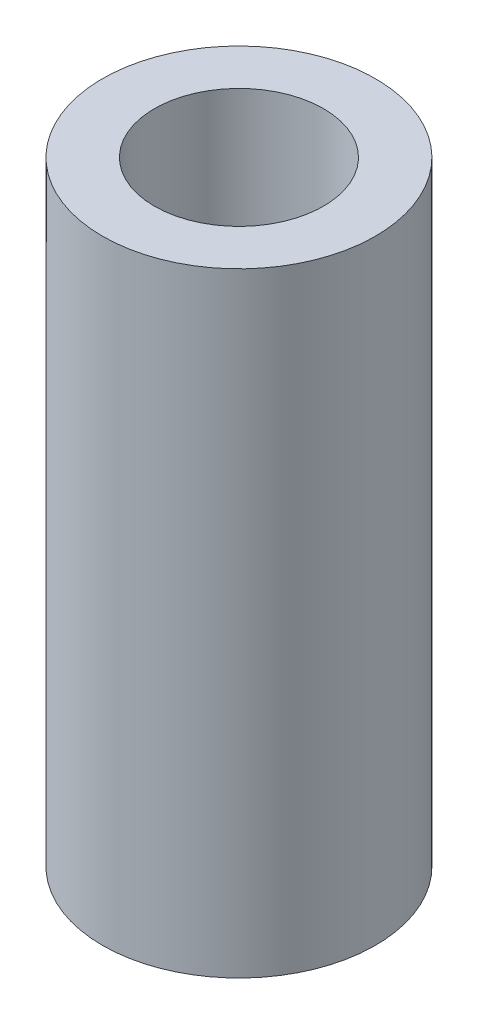
ISO-10303-21;
HEADER;
FILE_DESCRIPTION(('STEP AP214'),'2;1');
FILE_NAME('part.step','',(''),(''),'','','');
FILE_SCHEMA(('AUTOMOTIVE_DESIGN { 1 0 10303 214 1 1 1 1 }'));
ENDSEC;
DATA;
#1=APPLICATION_CONTEXT('core data for automotive mechanical design processes');
#2=APPLICATION_PROTOCOL_DEFINITION('international standard','automotive_design',2000,#1);
#3=PRODUCT_CONTEXT('',#1,'mechanical');
#4=PRODUCT('Part','Part','',(#3));
#5=PRODUCT_RELATED_PRODUCT_CATEGORY('part','',(#4));
#6=PRODUCT_DEFINITION_FORMATION('','',#4);
#7=PRODUCT_DEFINITION_CONTEXT('part definition',#1,'design');
#8=PRODUCT_DEFINITION('design','',#6,#7);
#9=PRODUCT_DEFINITION_SHAPE('','',#8);
#10=(LENGTH_UNIT() NAMED_UNIT(*) SI_UNIT(.MILLI.,.METRE.));
#11=(NAMED_UNIT(*) PLANE_ANGLE_UNIT() SI_UNIT($,.RADIAN.));
#12=(NAMED_UNIT(*) SI_UNIT($,.STERADIAN.) SOLID_ANGLE_UNIT());
#13=UNCERTAINTY_MEASURE_WITH_UNIT(LENGTH_MEASURE(1.E-05),#10,'distance_accuracy_value','');
#14=(GEOMETRIC_REPRESENTATION_CONTEXT(3) GLOBAL_UNCERTAINTY_ASSIGNED_CONTEXT((#13)) GLOBAL_UNIT_ASSIGNED_CONTEXT((#10,
#11,#12)) REPRESENTATION_CONTEXT('',''));
#15=CARTESIAN_POINT('',(0.,0.,0.));
#16=DIRECTION('',(0.,0.,1.));
#17=DIRECTION('',(1.,0.,0.));
#18=AXIS2_PLACEMENT_3D('',#15,#16,#17);
#19=CARTESIAN_POINT('',(0.,56.2607572446748,0.));
#20=DIRECTION('',(0.,-1.,0.));
#21=DIRECTION('',(0.,0.,-1.));
#22=AXIS2_PLACEMENT_3D('',#19,#20,#21);
#23=CYLINDRICAL_SURFACE('',#22,12.5);
#24=CARTESIAN_POINT('',(0.,56.2607572446748,0.));
#25=DIRECTION('',(0.,1.,0.));
#26=DIRECTION('',(0.,0.,1.));
#27=AXIS2_PLACEMENT_3D('',#24,#25,#26);
#28=CIRCLE('',#27,12.5);
#29=CARTESIAN_POINT('',(0.,56.2607572446748,12.5));
#30=VERTEX_POINT('',#29);
#31=EDGE_CURVE('E10',#30,#30,#28,.T.);
#32=ORIENTED_EDGE('',*,*,#31,.F.);
#33=EDGE_LOOP('',(#32));
#34=FACE_BOUND('',#33,.T.);
#35=CARTESIAN_POINT('',(0.,0.,0.));
#36=DIRECTION('',(0.,1.,0.));
#37=DIRECTION('',(0.,0.,1.));
#38=AXIS2_PLACEMENT_3D('',#35,#36,#37);
#39=CIRCLE('',#38,12.5);
#40=CARTESIAN_POINT('',(0.,0.,12.5));
#41=VERTEX_POINT('',#40);
#42=EDGE_CURVE('E37',#41,#41,#39,.T.);
#43=ORIENTED_EDGE('',*,*,#42,.T.);
#44=EDGE_LOOP('',(#43));
#45=FACE_BOUND('',#44,.T.);
#46=ADVANCED_FACE('F40',(#34,#45),#23,.T.);
#47=CARTESIAN_POINT('',(0.,56.2607572446748,0.));
#48=DIRECTION('',(0.,1.,0.));
#49=DIRECTION('',(0.,0.,1.));
#50=AXIS2_PLACEMENT_3D('',#47,#48,#49);
#51=PLANE('',#50);
#52=CARTESIAN_POINT('',(0.,56.2607572446748,0.));
#53=DIRECTION('',(0.,1.,0.));
#54=DIRECTION('',(0.,0.,1.));
#55=AXIS2_PLACEMENT_3D('',#52,#53,#54);
#56=CIRCLE('',#55,7.74410078229966);
#57=CARTESIAN_POINT('',(0.,56.2607572446748,7.74410078229966));
#58=VERTEX_POINT('',#57);
#59=EDGE_CURVE('E50',#58,#58,#56,.T.);
#60=ORIENTED_EDGE('',*,*,#59,.F.);
#61=EDGE_LOOP('',(#60));
#62=FACE_BOUND('',#61,.T.);
#63=ORIENTED_EDGE('',*,*,#31,.T.);
#64=EDGE_LOOP('',(#63));
#65=FACE_BOUND('',#64,.T.);
#66=ADVANCED_FACE('F59',(#62,#65),#51,.T.);
#67=CARTESIAN_POINT('',(0.,0.,0.));
#68=DIRECTION('',(0.,1.,0.));
#69=DIRECTION('',(0.,0.,1.));
#70=AXIS2_PLACEMENT_3D('',#67,#68,#69);
#71=PLANE('',#70);
#72=CARTESIAN_POINT('',(0.,0.,0.));
#73=DIRECTION('',(0.,1.,0.));
#74=DIRECTION('',(0.,0.,1.));
#75=AXIS2_PLACEMENT_3D('',#72,#73,#74);
#76=CIRCLE('',#75,7.74410078229966);
#77=CARTESIAN_POINT('',(0.,0.,7.74410078229966));
#78=VERTEX_POINT('',#77);
#79=EDGE_CURVE('E47',#78,#78,#76,.T.);
#80=ORIENTED_EDGE('',*,*,#79,.T.);
#81=EDGE_LOOP('',(#80));
#82=FACE_BOUND('',#81,.T.);
#83=ORIENTED_EDGE('',*,*,#42,.F.);
#84=EDGE_LOOP('',(#83));
#85=FACE_BOUND('',#84,.T.);
#86=ADVANCED_FACE('F58',(#82,#85),#71,.F.);
#87=CARTESIAN_POINT('',(0.,56.2607572446748,0.));
#88=DIRECTION('',(0.,-1.,0.));
#89=DIRECTION('',(0.,0.,-1.));
#90=AXIS2_PLACEMENT_3D('',#87,#88,#89);
#91=CYLINDRICAL_SURFACE('',#90,7.74410078229966);
#92=ORIENTED_EDGE('',*,*,#59,.T.);
#93=EDGE_LOOP('',(#92));
#94=FACE_BOUND('',#93,.T.);
#95=ORIENTED_EDGE('',*,*,#79,.F.);
#96=EDGE_LOOP('',(#95));
#97=FACE_BOUND('',#96,.T.);
#98=ADVANCED_FACE('F54',(#94,#97),#91,.F.);
#99=CLOSED_SHELL('',(#46,#66,#86,#98));
#100=MANIFOLD_SOLID_BREP('B2',#99);
#101=ADVANCED_BREP_SHAPE_REPRESENTATION('',(#18,#100),#14);
#102=SHAPE_DEFINITION_REPRESENTATION(#9,#101);
ENDSEC;
END-ISO-10303-21;
